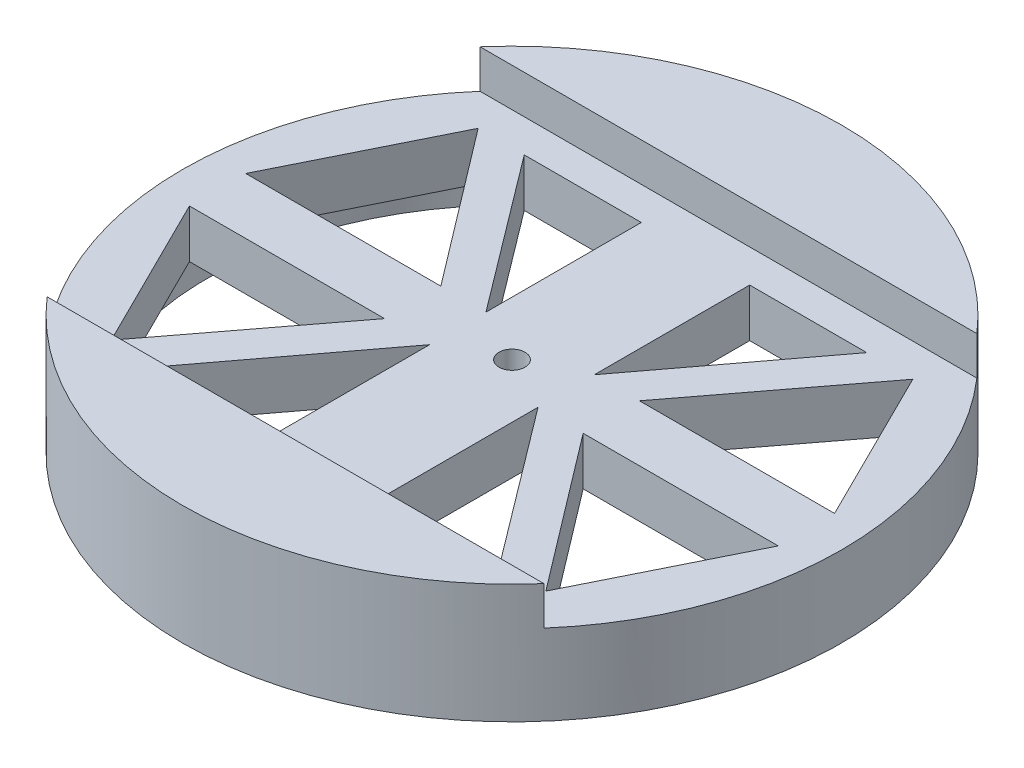
ISO-10303-21;
HEADER;
FILE_DESCRIPTION(('STEP AP214'),'2;1');
FILE_NAME('part.step','',(''),(''),'','','');
FILE_SCHEMA(('AUTOMOTIVE_DESIGN { 1 0 10303 214 1 1 1 1 }'));
ENDSEC;
DATA;
#1=APPLICATION_CONTEXT('core data for automotive mechanical design processes');
#2=APPLICATION_PROTOCOL_DEFINITION('international standard','automotive_design',2000,#1);
#3=PRODUCT_CONTEXT('',#1,'mechanical');
#4=PRODUCT('Part','Part','',(#3));
#5=PRODUCT_RELATED_PRODUCT_CATEGORY('part','',(#4));
#6=PRODUCT_DEFINITION_FORMATION('','',#4);
#7=PRODUCT_DEFINITION_CONTEXT('part definition',#1,'design');
#8=PRODUCT_DEFINITION('design','',#6,#7);
#9=PRODUCT_DEFINITION_SHAPE('','',#8);
#10=(LENGTH_UNIT() NAMED_UNIT(*) SI_UNIT(.MILLI.,.METRE.));
#11=(NAMED_UNIT(*) PLANE_ANGLE_UNIT() SI_UNIT($,.RADIAN.));
#12=(NAMED_UNIT(*) SI_UNIT($,.STERADIAN.) SOLID_ANGLE_UNIT());
#13=UNCERTAINTY_MEASURE_WITH_UNIT(LENGTH_MEASURE(1.E-05),#10,'distance_accuracy_value','');
#14=(GEOMETRIC_REPRESENTATION_CONTEXT(3) GLOBAL_UNCERTAINTY_ASSIGNED_CONTEXT((#13)) GLOBAL_UNIT_ASSIGNED_CONTEXT((#10,
#11,#12)) REPRESENTATION_CONTEXT('',''));
#15=CARTESIAN_POINT('',(0.,0.,0.));
#16=DIRECTION('',(0.,0.,1.));
#17=DIRECTION('',(1.,0.,0.));
#18=AXIS2_PLACEMENT_3D('',#15,#16,#17);
#19=CARTESIAN_POINT('',(0.,-1.39,0.));
#20=DIRECTION('',(0.,1.,0.));
#21=DIRECTION('',(0.,0.,1.));
#22=AXIS2_PLACEMENT_3D('',#19,#20,#21);
#23=CYLINDRICAL_SURFACE('',#22,3.);
#24=CARTESIAN_POINT('',(0.,18.61,0.));
#25=DIRECTION('',(0.,1.,0.));
#26=DIRECTION('',(0.,0.,1.));
#27=AXIS2_PLACEMENT_3D('',#24,#25,#26);
#28=CIRCLE('',#27,3.);
#29=CARTESIAN_POINT('',(0.,18.61,3.));
#30=VERTEX_POINT('',#29);
#31=EDGE_CURVE('E336',#30,#30,#28,.T.);
#32=ORIENTED_EDGE('',*,*,#31,.T.);
#33=EDGE_LOOP('',(#32));
#34=FACE_BOUND('',#33,.T.);
#35=CARTESIAN_POINT('',(0.,7.5,0.));
#36=DIRECTION('',(0.,-1.,0.));
#37=DIRECTION('',(0.,0.,-1.));
#38=AXIS2_PLACEMENT_3D('',#35,#36,#37);
#39=CIRCLE('',#38,3.);
#40=CARTESIAN_POINT('',(0.,7.5,-3.));
#41=VERTEX_POINT('',#40);
#42=EDGE_CURVE('E253',#41,#41,#39,.F.);
#43=ORIENTED_EDGE('',*,*,#42,.F.);
#44=EDGE_LOOP('',(#43));
#45=FACE_BOUND('',#44,.T.);
#46=ADVANCED_FACE('F44',(#34,#45),#23,.F.);
#47=CARTESIAN_POINT('',(-22.902913425769,0.,-6.49059266367803));
#48=DIRECTION('',(0.796272370202326,0.,-0.604938271604938));
#49=DIRECTION('',(-0.604938271604938,0.,-0.796272370202326));
#50=AXIS2_PLACEMENT_3D('',#47,#48,#49);
#51=PLANE('',#50);
#52=DIRECTION('',(-0.604938271604938,0.,-0.796272370202326));
#53=VECTOR('',#52,1.);
#54=CARTESIAN_POINT('',(-22.902913425769,7.5,-6.49059266367803));
#55=LINE('',#54,#53);
#56=CARTESIAN_POINT('',(-22.902913425769,7.5,-6.49059266367803));
#57=VERTEX_POINT('',#56);
#58=CARTESIAN_POINT('',(-50.1251356479912,7.5,-42.3228493227827));
#59=VERTEX_POINT('',#58);
#60=EDGE_CURVE('E59',#57,#59,#55,.T.);
#61=ORIENTED_EDGE('',*,*,#60,.F.);
#62=DIRECTION('',(0.,1.,0.));
#63=VECTOR('',#62,1.);
#64=CARTESIAN_POINT('',(-22.902913425769,0.,-6.49059266367803));
#65=LINE('',#64,#63);
#66=CARTESIAN_POINT('',(-22.902913425769,18.61,-6.49059266367803));
#67=VERTEX_POINT('',#66);
#68=EDGE_CURVE('E334',#57,#67,#65,.T.);
#69=ORIENTED_EDGE('',*,*,#68,.T.);
#70=DIRECTION('',(-0.604938271604938,0.,-0.796272370202326));
#71=VECTOR('',#70,1.);
#72=CARTESIAN_POINT('',(-22.902913425769,18.61,-6.49059266367803));
#73=LINE('',#72,#71);
#74=CARTESIAN_POINT('',(-50.1251356479912,18.61,-42.3228493227827));
#75=VERTEX_POINT('',#74);
#76=EDGE_CURVE('E296',#67,#75,#73,.T.);
#77=ORIENTED_EDGE('',*,*,#76,.T.);
#78=DIRECTION('',(0.,1.,0.));
#79=VECTOR('',#78,1.);
#80=CARTESIAN_POINT('',(-50.1251356479912,0.,-42.3228493227827));
#81=LINE('',#80,#79);
#82=EDGE_CURVE('E333',#59,#75,#81,.T.);
#83=ORIENTED_EDGE('',*,*,#82,.F.);
#84=EDGE_LOOP('',(#61,#69,#77,#83));
#85=FACE_BOUND('',#84,.T.);
#86=ADVANCED_FACE('F399',(#85),#51,.F.);
#87=CARTESIAN_POINT('',(-67.902913425769,0.,-6.49059266367803));
#88=DIRECTION('',(0.,0.,1.));
#89=DIRECTION('',(1.,0.,0.));
#90=AXIS2_PLACEMENT_3D('',#87,#88,#89);
#91=PLANE('',#90);
#92=DIRECTION('',(1.,0.,0.));
#93=VECTOR('',#92,1.);
#94=CARTESIAN_POINT('',(-67.902913425769,7.5,-6.49059266367803));
#95=LINE('',#94,#93);
#96=CARTESIAN_POINT('',(-67.902913425769,7.5,-6.49059266367803));
#97=VERTEX_POINT('',#96);
#98=EDGE_CURVE('E522',#97,#57,#95,.T.);
#99=ORIENTED_EDGE('',*,*,#98,.F.);
#100=DIRECTION('',(0.,1.,0.));
#101=VECTOR('',#100,1.);
#102=CARTESIAN_POINT('',(-67.902913425769,0.,-6.49059266367803));
#103=LINE('',#102,#101);
#104=CARTESIAN_POINT('',(-67.902913425769,18.61,-6.49059266367803));
#105=VERTEX_POINT('',#104);
#106=EDGE_CURVE('E337',#97,#105,#103,.T.);
#107=ORIENTED_EDGE('',*,*,#106,.T.);
#108=DIRECTION('',(1.,0.,0.));
#109=VECTOR('',#108,1.);
#110=CARTESIAN_POINT('',(-67.902913425769,18.61,-6.49059266367803));
#111=LINE('',#110,#109);
#112=EDGE_CURVE('E330',#105,#67,#111,.T.);
#113=ORIENTED_EDGE('',*,*,#112,.T.);
#114=ORIENTED_EDGE('',*,*,#68,.F.);
#115=EDGE_LOOP('',(#99,#107,#113,#114));
#116=FACE_BOUND('',#115,.T.);
#117=ADVANCED_FACE('F406',(#116),#91,.F.);
#118=CARTESIAN_POINT('',(-50.1251356479912,0.,-42.3228493227827));
#119=DIRECTION('',(-0.895806416477617,0.,-0.444444444444444));
#120=DIRECTION('',(-0.444444444444444,0.,0.895806416477617));
#121=AXIS2_PLACEMENT_3D('',#118,#119,#120);
#122=PLANE('',#121);
#123=DIRECTION('',(-0.444444444444444,0.,0.895806416477617));
#124=VECTOR('',#123,1.);
#125=CARTESIAN_POINT('',(-50.1251356479912,7.5,-42.3228493227827));
#126=LINE('',#125,#124);
#127=EDGE_CURVE('E519',#59,#97,#126,.T.);
#128=ORIENTED_EDGE('',*,*,#127,.F.);
#129=ORIENTED_EDGE('',*,*,#82,.T.);
#130=DIRECTION('',(-0.444444444444444,0.,0.895806416477617));
#131=VECTOR('',#130,1.);
#132=CARTESIAN_POINT('',(-50.1251356479912,18.61,-42.3228493227827));
#133=LINE('',#132,#131);
#134=EDGE_CURVE('E327',#75,#105,#133,.T.);
#135=ORIENTED_EDGE('',*,*,#134,.T.);
#136=ORIENTED_EDGE('',*,*,#106,.F.);
#137=EDGE_LOOP('',(#128,#129,#135,#136));
#138=FACE_BOUND('',#137,.T.);
#139=ADVANCED_FACE('F480',(#138),#122,.F.);
#140=CARTESIAN_POINT('',(50.1251356479912,0.,-42.3228493227827));
#141=DIRECTION('',(0.895806416477617,0.,-0.444444444444444));
#142=DIRECTION('',(-0.444444444444444,0.,-0.895806416477617));
#143=AXIS2_PLACEMENT_3D('',#140,#141,#142);
#144=PLANE('',#143);
#145=DIRECTION('',(-0.444444444444444,0.,-0.895806416477617));
#146=VECTOR('',#145,1.);
#147=CARTESIAN_POINT('',(50.1251356479912,7.5,-42.3228493227827));
#148=LINE('',#147,#146);
#149=CARTESIAN_POINT('',(67.902913425769,7.5,-6.49059266367803));
#150=VERTEX_POINT('',#149);
#151=CARTESIAN_POINT('',(50.1251356479912,7.5,-42.3228493227827));
#152=VERTEX_POINT('',#151);
#153=EDGE_CURVE('E67',#150,#152,#148,.T.);
#154=ORIENTED_EDGE('',*,*,#153,.F.);
#155=DIRECTION('',(0.,1.,0.));
#156=VECTOR('',#155,1.);
#157=CARTESIAN_POINT('',(67.902913425769,0.,-6.49059266367803));
#158=LINE('',#157,#156);
#159=CARTESIAN_POINT('',(67.902913425769,18.61,-6.49059266367803));
#160=VERTEX_POINT('',#159);
#161=EDGE_CURVE('E285',#150,#160,#158,.T.);
#162=ORIENTED_EDGE('',*,*,#161,.T.);
#163=DIRECTION('',(-0.444444444444444,0.,-0.895806416477617));
#164=VECTOR('',#163,1.);
#165=CARTESIAN_POINT('',(50.1251356479912,18.61,-42.3228493227827));
#166=LINE('',#165,#164);
#167=CARTESIAN_POINT('',(50.1251356479912,18.61,-42.3228493227827));
#168=VERTEX_POINT('',#167);
#169=EDGE_CURVE('E293',#160,#168,#166,.T.);
#170=ORIENTED_EDGE('',*,*,#169,.T.);
#171=DIRECTION('',(0.,1.,0.));
#172=VECTOR('',#171,1.);
#173=CARTESIAN_POINT('',(50.1251356479912,0.,-42.3228493227827));
#174=LINE('',#173,#172);
#175=EDGE_CURVE('E280',#152,#168,#174,.T.);
#176=ORIENTED_EDGE('',*,*,#175,.F.);
#177=EDGE_LOOP('',(#154,#162,#170,#176));
#178=FACE_BOUND('',#177,.T.);
#179=ADVANCED_FACE('F476',(#178),#144,.F.);
#180=CARTESIAN_POINT('',(67.902913425769,0.,-6.49059266367803));
#181=DIRECTION('',(0.,0.,1.));
#182=DIRECTION('',(1.,0.,0.));
#183=AXIS2_PLACEMENT_3D('',#180,#181,#182);
#184=PLANE('',#183);
#185=DIRECTION('',(1.,0.,0.));
#186=VECTOR('',#185,1.);
#187=CARTESIAN_POINT('',(67.902913425769,7.5,-6.49059266367803));
#188=LINE('',#187,#186);
#189=CARTESIAN_POINT('',(22.902913425769,7.5,-6.49059266367804));
#190=VERTEX_POINT('',#189);
#191=EDGE_CURVE('E608',#190,#150,#188,.T.);
#192=ORIENTED_EDGE('',*,*,#191,.F.);
#193=DIRECTION('',(0.,1.,0.));
#194=VECTOR('',#193,1.);
#195=CARTESIAN_POINT('',(22.902913425769,0.,-6.49059266367804));
#196=LINE('',#195,#194);
#197=CARTESIAN_POINT('',(22.902913425769,18.61,-6.49059266367804));
#198=VERTEX_POINT('',#197);
#199=EDGE_CURVE('E283',#190,#198,#196,.T.);
#200=ORIENTED_EDGE('',*,*,#199,.T.);
#201=DIRECTION('',(1.,0.,0.));
#202=VECTOR('',#201,1.);
#203=CARTESIAN_POINT('',(67.902913425769,18.61,-6.49059266367803));
#204=LINE('',#203,#202);
#205=EDGE_CURVE('E282',#198,#160,#204,.T.);
#206=ORIENTED_EDGE('',*,*,#205,.T.);
#207=ORIENTED_EDGE('',*,*,#161,.F.);
#208=EDGE_LOOP('',(#192,#200,#206,#207));
#209=FACE_BOUND('',#208,.T.);
#210=ADVANCED_FACE('F479',(#209),#184,.F.);
#211=CARTESIAN_POINT('',(22.902913425769,0.,-6.49059266367804));
#212=DIRECTION('',(-0.796272370202326,0.,-0.604938271604938));
#213=DIRECTION('',(-0.604938271604938,0.,0.796272370202326));
#214=AXIS2_PLACEMENT_3D('',#211,#212,#213);
#215=PLANE('',#214);
#216=DIRECTION('',(-0.604938271604938,0.,0.796272370202326));
#217=VECTOR('',#216,1.);
#218=CARTESIAN_POINT('',(22.902913425769,7.5,-6.49059266367804));
#219=LINE('',#218,#217);
#220=EDGE_CURVE('E606',#152,#190,#219,.T.);
#221=ORIENTED_EDGE('',*,*,#220,.F.);
#222=ORIENTED_EDGE('',*,*,#175,.T.);
#223=DIRECTION('',(-0.604938271604938,0.,0.796272370202326));
#224=VECTOR('',#223,1.);
#225=CARTESIAN_POINT('',(22.902913425769,18.61,-6.49059266367804));
#226=LINE('',#225,#224);
#227=EDGE_CURVE('E290',#168,#198,#226,.T.);
#228=ORIENTED_EDGE('',*,*,#227,.T.);
#229=ORIENTED_EDGE('',*,*,#199,.F.);
#230=EDGE_LOOP('',(#221,#222,#228,#229));
#231=FACE_BOUND('',#230,.T.);
#232=ADVANCED_FACE('F482',(#231),#215,.F.);
#233=CARTESIAN_POINT('',(22.902913425769,0.,6.49059266367804));
#234=DIRECTION('',(-0.796272370202326,0.,0.604938271604938));
#235=DIRECTION('',(0.604938271604938,0.,0.796272370202326));
#236=AXIS2_PLACEMENT_3D('',#233,#234,#235);
#237=PLANE('',#236);
#238=DIRECTION('',(0.604938271604938,0.,0.796272370202326));
#239=VECTOR('',#238,1.);
#240=CARTESIAN_POINT('',(22.902913425769,7.5,6.49059266367804));
#241=LINE('',#240,#239);
#242=CARTESIAN_POINT('',(22.902913425769,7.5,6.49059266367804));
#243=VERTEX_POINT('',#242);
#244=CARTESIAN_POINT('',(50.1251356479912,7.5,42.3228493227827));
#245=VERTEX_POINT('',#244);
#246=EDGE_CURVE('E604',#243,#245,#241,.T.);
#247=ORIENTED_EDGE('',*,*,#246,.F.);
#248=DIRECTION('',(0.,1.,0.));
#249=VECTOR('',#248,1.);
#250=CARTESIAN_POINT('',(22.902913425769,0.,6.49059266367804));
#251=LINE('',#250,#249);
#252=CARTESIAN_POINT('',(22.902913425769,18.61,6.49059266367804));
#253=VERTEX_POINT('',#252);
#254=EDGE_CURVE('E302',#243,#253,#251,.T.);
#255=ORIENTED_EDGE('',*,*,#254,.T.);
#256=DIRECTION('',(0.604938271604938,0.,0.796272370202326));
#257=VECTOR('',#256,1.);
#258=CARTESIAN_POINT('',(22.902913425769,18.61,6.49059266367804));
#259=LINE('',#258,#257);
#260=CARTESIAN_POINT('',(50.1251356479912,18.61,42.3228493227827));
#261=VERTEX_POINT('',#260);
#262=EDGE_CURVE('E287',#253,#261,#259,.T.);
#263=ORIENTED_EDGE('',*,*,#262,.T.);
#264=DIRECTION('',(0.,1.,0.));
#265=VECTOR('',#264,1.);
#266=CARTESIAN_POINT('',(50.1251356479912,0.,42.3228493227827));
#267=LINE('',#266,#265);
#268=EDGE_CURVE('E297',#245,#261,#267,.T.);
#269=ORIENTED_EDGE('',*,*,#268,.F.);
#270=EDGE_LOOP('',(#247,#255,#263,#269));
#271=FACE_BOUND('',#270,.T.);
#272=ADVANCED_FACE('F485',(#271),#237,.F.);
#273=CARTESIAN_POINT('',(67.902913425769,0.,6.49059266367803));
#274=DIRECTION('',(0.,0.,-1.));
#275=DIRECTION('',(-1.,0.,0.));
#276=AXIS2_PLACEMENT_3D('',#273,#274,#275);
#277=PLANE('',#276);
#278=DIRECTION('',(-1.,0.,0.));
#279=VECTOR('',#278,1.);
#280=CARTESIAN_POINT('',(67.902913425769,7.5,6.49059266367803));
#281=LINE('',#280,#279);
#282=CARTESIAN_POINT('',(67.902913425769,7.5,6.49059266367803));
#283=VERTEX_POINT('',#282);
#284=EDGE_CURVE('E602',#283,#243,#281,.T.);
#285=ORIENTED_EDGE('',*,*,#284,.F.);
#286=DIRECTION('',(0.,1.,0.));
#287=VECTOR('',#286,1.);
#288=CARTESIAN_POINT('',(67.902913425769,0.,6.49059266367803));
#289=LINE('',#288,#287);
#290=CARTESIAN_POINT('',(67.902913425769,18.61,6.49059266367803));
#291=VERTEX_POINT('',#290);
#292=EDGE_CURVE('E300',#283,#291,#289,.T.);
#293=ORIENTED_EDGE('',*,*,#292,.T.);
#294=DIRECTION('',(-1.,0.,0.));
#295=VECTOR('',#294,1.);
#296=CARTESIAN_POINT('',(67.902913425769,18.61,6.49059266367803));
#297=LINE('',#296,#295);
#298=EDGE_CURVE('E299',#291,#253,#297,.T.);
#299=ORIENTED_EDGE('',*,*,#298,.T.);
#300=ORIENTED_EDGE('',*,*,#254,.F.);
#301=EDGE_LOOP('',(#285,#293,#299,#300));
#302=FACE_BOUND('',#301,.T.);
#303=ADVANCED_FACE('F492',(#302),#277,.F.);
#304=CARTESIAN_POINT('',(50.1251356479912,0.,42.3228493227827));
#305=DIRECTION('',(0.895806416477617,0.,0.444444444444444));
#306=DIRECTION('',(0.444444444444444,0.,-0.895806416477617));
#307=AXIS2_PLACEMENT_3D('',#304,#305,#306);
#308=PLANE('',#307);
#309=DIRECTION('',(0.444444444444444,0.,-0.895806416477617));
#310=VECTOR('',#309,1.);
#311=CARTESIAN_POINT('',(50.1251356479912,7.5,42.3228493227827));
#312=LINE('',#311,#310);
#313=EDGE_CURVE('E600',#245,#283,#312,.T.);
#314=ORIENTED_EDGE('',*,*,#313,.F.);
#315=ORIENTED_EDGE('',*,*,#268,.T.);
#316=DIRECTION('',(0.444444444444444,0.,-0.895806416477617));
#317=VECTOR('',#316,1.);
#318=CARTESIAN_POINT('',(50.1251356479912,18.61,42.3228493227827));
#319=LINE('',#318,#317);
#320=EDGE_CURVE('E307',#261,#291,#319,.T.);
#321=ORIENTED_EDGE('',*,*,#320,.T.);
#322=ORIENTED_EDGE('',*,*,#292,.F.);
#323=EDGE_LOOP('',(#314,#315,#321,#322));
#324=FACE_BOUND('',#323,.T.);
#325=ADVANCED_FACE('F494',(#324),#308,.F.);
#326=CARTESIAN_POINT('',(-50.1251356479912,0.,42.3228493227827));
#327=DIRECTION('',(-0.895806416477617,0.,0.444444444444444));
#328=DIRECTION('',(0.444444444444444,0.,0.895806416477617));
#329=AXIS2_PLACEMENT_3D('',#326,#327,#328);
#330=PLANE('',#329);
#331=DIRECTION('',(0.444444444444444,0.,0.895806416477617));
#332=VECTOR('',#331,1.);
#333=CARTESIAN_POINT('',(-50.1251356479912,7.5,42.3228493227827));
#334=LINE('',#333,#332);
#335=CARTESIAN_POINT('',(-67.902913425769,7.5,6.49059266367802));
#336=VERTEX_POINT('',#335);
#337=CARTESIAN_POINT('',(-50.1251356479912,7.5,42.3228493227827));
#338=VERTEX_POINT('',#337);
#339=EDGE_CURVE('E598',#336,#338,#334,.T.);
#340=ORIENTED_EDGE('',*,*,#339,.F.);
#341=DIRECTION('',(0.,1.,0.));
#342=VECTOR('',#341,1.);
#343=CARTESIAN_POINT('',(-67.902913425769,0.,6.49059266367802));
#344=LINE('',#343,#342);
#345=CARTESIAN_POINT('',(-67.902913425769,18.61,6.49059266367802));
#346=VERTEX_POINT('',#345);
#347=EDGE_CURVE('E276',#336,#346,#344,.T.);
#348=ORIENTED_EDGE('',*,*,#347,.T.);
#349=DIRECTION('',(0.444444444444444,0.,0.895806416477617));
#350=VECTOR('',#349,1.);
#351=CARTESIAN_POINT('',(-50.1251356479912,18.61,42.3228493227827));
#352=LINE('',#351,#350);
#353=CARTESIAN_POINT('',(-50.1251356479912,18.61,42.3228493227827));
#354=VERTEX_POINT('',#353);
#355=EDGE_CURVE('E304',#346,#354,#352,.T.);
#356=ORIENTED_EDGE('',*,*,#355,.T.);
#357=DIRECTION('',(0.,1.,0.));
#358=VECTOR('',#357,1.);
#359=CARTESIAN_POINT('',(-50.1251356479912,0.,42.3228493227827));
#360=LINE('',#359,#358);
#361=EDGE_CURVE('E312',#338,#354,#360,.T.);
#362=ORIENTED_EDGE('',*,*,#361,.F.);
#363=EDGE_LOOP('',(#340,#348,#356,#362));
#364=FACE_BOUND('',#363,.T.);
#365=ADVANCED_FACE('F497',(#364),#330,.F.);
#366=CARTESIAN_POINT('',(-67.902913425769,0.,6.49059266367802));
#367=DIRECTION('',(0.,0.,-1.));
#368=DIRECTION('',(-1.,0.,0.));
#369=AXIS2_PLACEMENT_3D('',#366,#367,#368);
#370=PLANE('',#369);
#371=DIRECTION('',(-1.,0.,0.));
#372=VECTOR('',#371,1.);
#373=CARTESIAN_POINT('',(-67.902913425769,7.5,6.49059266367802));
#374=LINE('',#373,#372);
#375=CARTESIAN_POINT('',(-22.902913425769,7.5,6.49059266367803));
#376=VERTEX_POINT('',#375);
#377=EDGE_CURVE('E596',#376,#336,#374,.T.);
#378=ORIENTED_EDGE('',*,*,#377,.F.);
#379=DIRECTION('',(0.,1.,0.));
#380=VECTOR('',#379,1.);
#381=CARTESIAN_POINT('',(-22.902913425769,0.,6.49059266367803));
#382=LINE('',#381,#380);
#383=CARTESIAN_POINT('',(-22.902913425769,18.61,6.49059266367803));
#384=VERTEX_POINT('',#383);
#385=EDGE_CURVE('E315',#376,#384,#382,.T.);
#386=ORIENTED_EDGE('',*,*,#385,.T.);
#387=DIRECTION('',(-1.,0.,0.));
#388=VECTOR('',#387,1.);
#389=CARTESIAN_POINT('',(-67.902913425769,18.61,6.49059266367802));
#390=LINE('',#389,#388);
#391=EDGE_CURVE('E314',#384,#346,#390,.T.);
#392=ORIENTED_EDGE('',*,*,#391,.T.);
#393=ORIENTED_EDGE('',*,*,#347,.F.);
#394=EDGE_LOOP('',(#378,#386,#392,#393));
#395=FACE_BOUND('',#394,.T.);
#396=ADVANCED_FACE('F504',(#395),#370,.F.);
#397=CARTESIAN_POINT('',(-22.902913425769,0.,6.49059266367803));
#398=DIRECTION('',(0.796272370202326,0.,0.604938271604938));
#399=DIRECTION('',(0.604938271604938,0.,-0.796272370202326));
#400=AXIS2_PLACEMENT_3D('',#397,#398,#399);
#401=PLANE('',#400);
#402=DIRECTION('',(0.604938271604938,0.,-0.796272370202326));
#403=VECTOR('',#402,1.);
#404=CARTESIAN_POINT('',(-22.902913425769,7.5,6.49059266367803));
#405=LINE('',#404,#403);
#406=EDGE_CURVE('E594',#338,#376,#405,.T.);
#407=ORIENTED_EDGE('',*,*,#406,.F.);
#408=ORIENTED_EDGE('',*,*,#361,.T.);
#409=DIRECTION('',(0.604938271604938,0.,-0.796272370202326));
#410=VECTOR('',#409,1.);
#411=CARTESIAN_POINT('',(-22.902913425769,18.61,6.49059266367803));
#412=LINE('',#411,#410);
#413=EDGE_CURVE('E320',#354,#384,#412,.T.);
#414=ORIENTED_EDGE('',*,*,#413,.T.);
#415=ORIENTED_EDGE('',*,*,#385,.F.);
#416=EDGE_LOOP('',(#407,#408,#414,#415));
#417=FACE_BOUND('',#416,.T.);
#418=ADVANCED_FACE('F474',(#417),#401,.F.);
#419=CARTESIAN_POINT('',(-12.5,0.,-6.49059266367805));
#420=DIRECTION('',(-0.798652029973296,0.,0.601793099843737));
#421=DIRECTION('',(0.601793099843737,0.,0.798652029973296));
#422=AXIS2_PLACEMENT_3D('',#419,#420,#421);
#423=PLANE('',#422);
#424=DIRECTION('',(0.601793099843737,0.,0.798652029973296));
#425=VECTOR('',#424,1.);
#426=CARTESIAN_POINT('',(-12.5,7.5,-6.49059266367805));
#427=LINE('',#426,#425);
#428=CARTESIAN_POINT('',(-39.5,7.5,-42.3228493227827));
#429=VERTEX_POINT('',#428);
#430=CARTESIAN_POINT('',(-12.5,7.5,-6.49059266367805));
#431=VERTEX_POINT('',#430);
#432=EDGE_CURVE('E592',#429,#431,#427,.T.);
#433=ORIENTED_EDGE('',*,*,#432,.F.);
#434=DIRECTION('',(0.,1.,0.));
#435=VECTOR('',#434,1.);
#436=CARTESIAN_POINT('',(-39.5,0.,-42.3228493227827));
#437=LINE('',#436,#435);
#438=CARTESIAN_POINT('',(-39.5,18.61,-42.3228493227827));
#439=VERTEX_POINT('',#438);
#440=EDGE_CURVE('E274',#429,#439,#437,.T.);
#441=ORIENTED_EDGE('',*,*,#440,.T.);
#442=DIRECTION('',(0.601793099843737,0.,0.798652029973296));
#443=VECTOR('',#442,1.);
#444=CARTESIAN_POINT('',(-12.5,18.61,-6.49059266367805));
#445=LINE('',#444,#443);
#446=CARTESIAN_POINT('',(-12.5,18.61,-6.49059266367805));
#447=VERTEX_POINT('',#446);
#448=EDGE_CURVE('E263',#439,#447,#445,.T.);
#449=ORIENTED_EDGE('',*,*,#448,.T.);
#450=DIRECTION('',(0.,1.,0.));
#451=VECTOR('',#450,1.);
#452=CARTESIAN_POINT('',(-12.5,0.,-6.49059266367805));
#453=LINE('',#452,#451);
#454=EDGE_CURVE('E273',#431,#447,#453,.T.);
#455=ORIENTED_EDGE('',*,*,#454,.F.);
#456=EDGE_LOOP('',(#433,#441,#449,#455));
#457=FACE_BOUND('',#456,.T.);
#458=ADVANCED_FACE('F467',(#457),#423,.F.);
#459=CARTESIAN_POINT('',(-12.5,0.,-42.3228493227827));
#460=DIRECTION('',(0.,0.,-1.));
#461=DIRECTION('',(-1.,0.,0.));
#462=AXIS2_PLACEMENT_3D('',#459,#460,#461);
#463=PLANE('',#462);
#464=DIRECTION('',(-1.,0.,0.));
#465=VECTOR('',#464,1.);
#466=CARTESIAN_POINT('',(-12.5,7.5,-42.3228493227827));
#467=LINE('',#466,#465);
#468=CARTESIAN_POINT('',(-12.5,7.5,-42.3228493227827));
#469=VERTEX_POINT('',#468);
#470=EDGE_CURVE('E590',#469,#429,#467,.T.);
#471=ORIENTED_EDGE('',*,*,#470,.F.);
#472=DIRECTION('',(0.,1.,0.));
#473=VECTOR('',#472,1.);
#474=CARTESIAN_POINT('',(-12.5,0.,-42.3228493227827));
#475=LINE('',#474,#473);
#476=CARTESIAN_POINT('',(-12.5,18.61,-42.3228493227827));
#477=VERTEX_POINT('',#476);
#478=EDGE_CURVE('E277',#469,#477,#475,.T.);
#479=ORIENTED_EDGE('',*,*,#478,.T.);
#480=DIRECTION('',(-1.,0.,0.));
#481=VECTOR('',#480,1.);
#482=CARTESIAN_POINT('',(-12.5,18.61,-42.3228493227827));
#483=LINE('',#482,#481);
#484=EDGE_CURVE('E270',#477,#439,#483,.T.);
#485=ORIENTED_EDGE('',*,*,#484,.T.);
#486=ORIENTED_EDGE('',*,*,#440,.F.);
#487=EDGE_LOOP('',(#471,#479,#485,#486));
#488=FACE_BOUND('',#487,.T.);
#489=ADVANCED_FACE('F464',(#488),#463,.F.);
#490=CARTESIAN_POINT('',(-12.5,0.,-6.49059266367805));
#491=DIRECTION('',(1.,0.,0.));
#492=DIRECTION('',(0.,0.,-1.));
#493=AXIS2_PLACEMENT_3D('',#490,#491,#492);
#494=PLANE('',#493);
#495=DIRECTION('',(0.,0.,-1.));
#496=VECTOR('',#495,1.);
#497=CARTESIAN_POINT('',(-12.5,7.5,-6.49059266367805));
#498=LINE('',#497,#496);
#499=EDGE_CURVE('E588',#431,#469,#498,.T.);
#500=ORIENTED_EDGE('',*,*,#499,.F.);
#501=ORIENTED_EDGE('',*,*,#454,.T.);
#502=DIRECTION('',(0.,0.,-1.));
#503=VECTOR('',#502,1.);
#504=CARTESIAN_POINT('',(-12.5,18.61,-6.49059266367805));
#505=LINE('',#504,#503);
#506=EDGE_CURVE('E266',#447,#477,#505,.T.);
#507=ORIENTED_EDGE('',*,*,#506,.T.);
#508=ORIENTED_EDGE('',*,*,#478,.F.);
#509=EDGE_LOOP('',(#500,#501,#507,#508));
#510=FACE_BOUND('',#509,.T.);
#511=ADVANCED_FACE('F437',(#510),#494,.F.);
#512=CARTESIAN_POINT('',(12.5,0.,-6.49059266367805));
#513=DIRECTION('',(-1.,0.,0.));
#514=DIRECTION('',(0.,0.,1.));
#515=AXIS2_PLACEMENT_3D('',#512,#513,#514);
#516=PLANE('',#515);
#517=DIRECTION('',(0.,0.,1.));
#518=VECTOR('',#517,1.);
#519=CARTESIAN_POINT('',(12.5,7.5,-6.49059266367805));
#520=LINE('',#519,#518);
#521=CARTESIAN_POINT('',(12.5,7.5,-42.3228493227827));
#522=VERTEX_POINT('',#521);
#523=CARTESIAN_POINT('',(12.5,7.5,-6.49059266367805));
#524=VERTEX_POINT('',#523);
#525=EDGE_CURVE('E586',#522,#524,#520,.T.);
#526=ORIENTED_EDGE('',*,*,#525,.F.);
#527=DIRECTION('',(0.,1.,0.));
#528=VECTOR('',#527,1.);
#529=CARTESIAN_POINT('',(12.5,0.,-42.3228493227827));
#530=LINE('',#529,#528);
#531=CARTESIAN_POINT('',(12.5,18.61,-42.3228493227827));
#532=VERTEX_POINT('',#531);
#533=EDGE_CURVE('E541',#522,#532,#530,.T.);
#534=ORIENTED_EDGE('',*,*,#533,.T.);
#535=DIRECTION('',(0.,0.,1.));
#536=VECTOR('',#535,1.);
#537=CARTESIAN_POINT('',(12.5,18.61,-6.49059266367805));
#538=LINE('',#537,#536);
#539=CARTESIAN_POINT('',(12.5,18.61,-6.49059266367805));
#540=VERTEX_POINT('',#539);
#541=EDGE_CURVE('E267',#532,#540,#538,.T.);
#542=ORIENTED_EDGE('',*,*,#541,.T.);
#543=DIRECTION('',(0.,1.,0.));
#544=VECTOR('',#543,1.);
#545=CARTESIAN_POINT('',(12.5,0.,-6.49059266367805));
#546=LINE('',#545,#544);
#547=EDGE_CURVE('E536',#524,#540,#546,.T.);
#548=ORIENTED_EDGE('',*,*,#547,.F.);
#549=EDGE_LOOP('',(#526,#534,#542,#548));
#550=FACE_BOUND('',#549,.T.);
#551=ADVANCED_FACE('F433',(#550),#516,.F.);
#552=CARTESIAN_POINT('',(12.5,0.,-42.3228493227827));
#553=DIRECTION('',(0.,0.,-1.));
#554=DIRECTION('',(-1.,0.,0.));
#555=AXIS2_PLACEMENT_3D('',#552,#553,#554);
#556=PLANE('',#555);
#557=DIRECTION('',(-1.,0.,0.));
#558=VECTOR('',#557,1.);
#559=CARTESIAN_POINT('',(12.5,7.5,-42.3228493227827));
#560=LINE('',#559,#558);
#561=CARTESIAN_POINT('',(39.5,7.5,-42.3228493227827));
#562=VERTEX_POINT('',#561);
#563=EDGE_CURVE('E584',#562,#522,#560,.T.);
#564=ORIENTED_EDGE('',*,*,#563,.F.);
#565=DIRECTION('',(0.,1.,0.));
#566=VECTOR('',#565,1.);
#567=CARTESIAN_POINT('',(39.5,0.,-42.3228493227827));
#568=LINE('',#567,#566);
#569=CARTESIAN_POINT('',(39.5,18.61,-42.3228493227827));
#570=VERTEX_POINT('',#569);
#571=EDGE_CURVE('E539',#562,#570,#568,.T.);
#572=ORIENTED_EDGE('',*,*,#571,.T.);
#573=DIRECTION('',(-1.,0.,0.));
#574=VECTOR('',#573,1.);
#575=CARTESIAN_POINT('',(12.5,18.61,-42.3228493227827));
#576=LINE('',#575,#574);
#577=EDGE_CURVE('E538',#570,#532,#576,.T.);
#578=ORIENTED_EDGE('',*,*,#577,.T.);
#579=ORIENTED_EDGE('',*,*,#533,.F.);
#580=EDGE_LOOP('',(#564,#572,#578,#579));
#581=FACE_BOUND('',#580,.T.);
#582=ADVANCED_FACE('F436',(#581),#556,.F.);
#583=CARTESIAN_POINT('',(12.5,0.,-6.49059266367805));
#584=DIRECTION('',(0.798652029973296,0.,0.601793099843737));
#585=DIRECTION('',(0.601793099843737,0.,-0.798652029973296));
#586=AXIS2_PLACEMENT_3D('',#583,#584,#585);
#587=PLANE('',#586);
#588=DIRECTION('',(0.601793099843737,0.,-0.798652029973296));
#589=VECTOR('',#588,1.);
#590=CARTESIAN_POINT('',(12.5,7.5,-6.49059266367805));
#591=LINE('',#590,#589);
#592=EDGE_CURVE('E582',#524,#562,#591,.T.);
#593=ORIENTED_EDGE('',*,*,#592,.F.);
#594=ORIENTED_EDGE('',*,*,#547,.T.);
#595=DIRECTION('',(0.601793099843737,0.,-0.798652029973296));
#596=VECTOR('',#595,1.);
#597=CARTESIAN_POINT('',(12.5,18.61,-6.49059266367805));
#598=LINE('',#597,#596);
#599=EDGE_CURVE('E546',#540,#570,#598,.T.);
#600=ORIENTED_EDGE('',*,*,#599,.T.);
#601=ORIENTED_EDGE('',*,*,#571,.F.);
#602=EDGE_LOOP('',(#593,#594,#600,#601));
#603=FACE_BOUND('',#602,.T.);
#604=ADVANCED_FACE('F439',(#603),#587,.F.);
#605=CARTESIAN_POINT('',(12.5,0.,6.49059266367805));
#606=DIRECTION('',(0.798652029973296,0.,-0.601793099843737));
#607=DIRECTION('',(-0.601793099843737,0.,-0.798652029973296));
#608=AXIS2_PLACEMENT_3D('',#605,#606,#607);
#609=PLANE('',#608);
#610=DIRECTION('',(-0.601793099843737,0.,-0.798652029973296));
#611=VECTOR('',#610,1.);
#612=CARTESIAN_POINT('',(12.5,7.5,6.49059266367805));
#613=LINE('',#612,#611);
#614=CARTESIAN_POINT('',(39.5,7.5,42.3228493227827));
#615=VERTEX_POINT('',#614);
#616=CARTESIAN_POINT('',(12.5,7.5,6.49059266367805));
#617=VERTEX_POINT('',#616);
#618=EDGE_CURVE('E577',#615,#617,#613,.T.);
#619=ORIENTED_EDGE('',*,*,#618,.F.);
#620=DIRECTION('',(0.,1.,0.));
#621=VECTOR('',#620,1.);
#622=CARTESIAN_POINT('',(39.5,0.,42.3228493227827));
#623=LINE('',#622,#621);
#624=CARTESIAN_POINT('',(39.5,18.61,42.3228493227827));
#625=VERTEX_POINT('',#624);
#626=EDGE_CURVE('E262',#615,#625,#623,.T.);
#627=ORIENTED_EDGE('',*,*,#626,.T.);
#628=DIRECTION('',(-0.601793099843737,0.,-0.798652029973296));
#629=VECTOR('',#628,1.);
#630=CARTESIAN_POINT('',(12.5,18.61,6.49059266367805));
#631=LINE('',#630,#629);
#632=CARTESIAN_POINT('',(12.5,18.61,6.49059266367805));
#633=VERTEX_POINT('',#632);
#634=EDGE_CURVE('E543',#625,#633,#631,.T.);
#635=ORIENTED_EDGE('',*,*,#634,.T.);
#636=DIRECTION('',(0.,1.,0.));
#637=VECTOR('',#636,1.);
#638=CARTESIAN_POINT('',(12.5,0.,6.49059266367805));
#639=LINE('',#638,#637);
#640=EDGE_CURVE('E551',#617,#633,#639,.T.);
#641=ORIENTED_EDGE('',*,*,#640,.F.);
#642=EDGE_LOOP('',(#619,#627,#635,#641));
#643=FACE_BOUND('',#642,.T.);
#644=ADVANCED_FACE('F442',(#643),#609,.F.);
#645=CARTESIAN_POINT('',(12.5,0.,42.3228493227827));
#646=DIRECTION('',(0.,0.,1.));
#647=DIRECTION('',(1.,0.,0.));
#648=AXIS2_PLACEMENT_3D('',#645,#646,#647);
#649=PLANE('',#648);
#650=DIRECTION('',(1.,0.,0.));
#651=VECTOR('',#650,1.);
#652=CARTESIAN_POINT('',(12.5,7.5,42.3228493227827));
#653=LINE('',#652,#651);
#654=CARTESIAN_POINT('',(12.5,7.5,42.3228493227827));
#655=VERTEX_POINT('',#654);
#656=EDGE_CURVE('E575',#655,#615,#653,.T.);
#657=ORIENTED_EDGE('',*,*,#656,.F.);
#658=DIRECTION('',(0.,1.,0.));
#659=VECTOR('',#658,1.);
#660=CARTESIAN_POINT('',(12.5,0.,42.3228493227827));
#661=LINE('',#660,#659);
#662=CARTESIAN_POINT('',(12.5,18.61,42.3228493227827));
#663=VERTEX_POINT('',#662);
#664=EDGE_CURVE('E554',#655,#663,#661,.T.);
#665=ORIENTED_EDGE('',*,*,#664,.T.);
#666=DIRECTION('',(1.,0.,0.));
#667=VECTOR('',#666,1.);
#668=CARTESIAN_POINT('',(12.5,18.61,42.3228493227827));
#669=LINE('',#668,#667);
#670=EDGE_CURVE('E553',#663,#625,#669,.T.);
#671=ORIENTED_EDGE('',*,*,#670,.T.);
#672=ORIENTED_EDGE('',*,*,#626,.F.);
#673=EDGE_LOOP('',(#657,#665,#671,#672));
#674=FACE_BOUND('',#673,.T.);
#675=ADVANCED_FACE('F449',(#674),#649,.F.);
#676=CARTESIAN_POINT('',(12.5,0.,6.49059266367805));
#677=DIRECTION('',(-1.,0.,0.));
#678=DIRECTION('',(0.,0.,1.));
#679=AXIS2_PLACEMENT_3D('',#676,#677,#678);
#680=PLANE('',#679);
#681=DIRECTION('',(0.,0.,1.));
#682=VECTOR('',#681,1.);
#683=CARTESIAN_POINT('',(12.5,7.5,6.49059266367805));
#684=LINE('',#683,#682);
#685=EDGE_CURVE('E572',#617,#655,#684,.T.);
#686=ORIENTED_EDGE('',*,*,#685,.F.);
#687=ORIENTED_EDGE('',*,*,#640,.T.);
#688=DIRECTION('',(0.,0.,1.));
#689=VECTOR('',#688,1.);
#690=CARTESIAN_POINT('',(12.5,18.61,6.49059266367805));
#691=LINE('',#690,#689);
#692=EDGE_CURVE('E559',#633,#663,#691,.T.);
#693=ORIENTED_EDGE('',*,*,#692,.T.);
#694=ORIENTED_EDGE('',*,*,#664,.F.);
#695=EDGE_LOOP('',(#686,#687,#693,#694));
#696=FACE_BOUND('',#695,.T.);
#697=ADVANCED_FACE('F451',(#696),#680,.F.);
#698=CARTESIAN_POINT('',(-12.5,0.,6.49059266367805));
#699=DIRECTION('',(1.,0.,0.));
#700=DIRECTION('',(0.,0.,-1.));
#701=AXIS2_PLACEMENT_3D('',#698,#699,#700);
#702=PLANE('',#701);
#703=DIRECTION('',(0.,0.,-1.));
#704=VECTOR('',#703,1.);
#705=CARTESIAN_POINT('',(-12.5,7.5,6.49059266367805));
#706=LINE('',#705,#704);
#707=CARTESIAN_POINT('',(-12.5,7.5,42.3228493227827));
#708=VERTEX_POINT('',#707);
#709=CARTESIAN_POINT('',(-12.5,7.5,6.49059266367805));
#710=VERTEX_POINT('',#709);
#711=EDGE_CURVE('E232',#708,#710,#706,.T.);
#712=ORIENTED_EDGE('',*,*,#711,.F.);
#713=DIRECTION('',(0.,1.,0.));
#714=VECTOR('',#713,1.);
#715=CARTESIAN_POINT('',(-12.5,0.,42.3228493227827));
#716=LINE('',#715,#714);
#717=CARTESIAN_POINT('',(-12.5,18.61,42.3228493227827));
#718=VERTEX_POINT('',#717);
#719=EDGE_CURVE('E242',#708,#718,#716,.T.);
#720=ORIENTED_EDGE('',*,*,#719,.T.);
#721=DIRECTION('',(0.,0.,-1.));
#722=VECTOR('',#721,1.);
#723=CARTESIAN_POINT('',(-12.5,18.61,6.49059266367805));
#724=LINE('',#723,#722);
#725=CARTESIAN_POINT('',(-12.5,18.61,6.49059266367805));
#726=VERTEX_POINT('',#725);
#727=EDGE_CURVE('E259',#718,#726,#724,.T.);
#728=ORIENTED_EDGE('',*,*,#727,.T.);
#729=DIRECTION('',(0.,1.,0.));
#730=VECTOR('',#729,1.);
#731=CARTESIAN_POINT('',(-12.5,0.,6.49059266367805));
#732=LINE('',#731,#730);
#733=EDGE_CURVE('E249',#710,#726,#732,.T.);
#734=ORIENTED_EDGE('',*,*,#733,.F.);
#735=EDGE_LOOP('',(#712,#720,#728,#734));
#736=FACE_BOUND('',#735,.T.);
#737=ADVANCED_FACE('F454',(#736),#702,.F.);
#738=CARTESIAN_POINT('',(-12.5,0.,42.3228493227827));
#739=DIRECTION('',(0.,0.,1.));
#740=DIRECTION('',(1.,0.,0.));
#741=AXIS2_PLACEMENT_3D('',#738,#739,#740);
#742=PLANE('',#741);
#743=DIRECTION('',(1.,0.,0.));
#744=VECTOR('',#743,1.);
#745=CARTESIAN_POINT('',(-12.5,7.5,42.3228493227827));
#746=LINE('',#745,#744);
#747=CARTESIAN_POINT('',(-39.5,7.5,42.3228493227827));
#748=VERTEX_POINT('',#747);
#749=EDGE_CURVE('E230',#748,#708,#746,.T.);
#750=ORIENTED_EDGE('',*,*,#749,.F.);
#751=DIRECTION('',(0.,1.,0.));
#752=VECTOR('',#751,1.);
#753=CARTESIAN_POINT('',(-39.5,0.,42.3228493227827));
#754=LINE('',#753,#752);
#755=CARTESIAN_POINT('',(-39.5,18.61,42.3228493227827));
#756=VERTEX_POINT('',#755);
#757=EDGE_CURVE('E240',#748,#756,#754,.T.);
#758=ORIENTED_EDGE('',*,*,#757,.T.);
#759=DIRECTION('',(1.,0.,0.));
#760=VECTOR('',#759,1.);
#761=CARTESIAN_POINT('',(-12.5,18.61,42.3228493227827));
#762=LINE('',#761,#760);
#763=EDGE_CURVE('E251',#756,#718,#762,.T.);
#764=ORIENTED_EDGE('',*,*,#763,.T.);
#765=ORIENTED_EDGE('',*,*,#719,.F.);
#766=EDGE_LOOP('',(#750,#758,#764,#765));
#767=FACE_BOUND('',#766,.T.);
#768=ADVANCED_FACE('F238',(#767),#742,.F.);
#769=CARTESIAN_POINT('',(-12.5,0.,6.49059266367805));
#770=DIRECTION('',(-0.798652029973296,0.,-0.601793099843737));
#771=DIRECTION('',(-0.601793099843737,0.,0.798652029973296));
#772=AXIS2_PLACEMENT_3D('',#769,#770,#771);
#773=PLANE('',#772);
#774=DIRECTION('',(-0.601793099843737,0.,0.798652029973296));
#775=VECTOR('',#774,1.);
#776=CARTESIAN_POINT('',(-12.5,7.5,6.49059266367805));
#777=LINE('',#776,#775);
#778=EDGE_CURVE('E11',#710,#748,#777,.T.);
#779=ORIENTED_EDGE('',*,*,#778,.F.);
#780=ORIENTED_EDGE('',*,*,#733,.T.);
#781=DIRECTION('',(-0.601793099843737,0.,0.798652029973296));
#782=VECTOR('',#781,1.);
#783=CARTESIAN_POINT('',(-12.5,18.61,6.49059266367805));
#784=LINE('',#783,#782);
#785=EDGE_CURVE('E247',#726,#756,#784,.T.);
#786=ORIENTED_EDGE('',*,*,#785,.T.);
#787=ORIENTED_EDGE('',*,*,#757,.F.);
#788=EDGE_LOOP('',(#779,#780,#786,#787));
#789=FACE_BOUND('',#788,.T.);
#790=ADVANCED_FACE('F245',(#789),#773,.F.);
#791=CARTESIAN_POINT('',(0.,27.5,0.));
#792=DIRECTION('',(0.,1.,0.));
#793=DIRECTION('',(0.,0.,1.));
#794=AXIS2_PLACEMENT_3D('',#791,#792,#793);
#795=PLANE('',#794);
#796=DIRECTION('',(-1.,0.,0.));
#797=VECTOR('',#796,1.);
#798=CARTESIAN_POINT('',(0.,27.5,-49.9317963849467));
#799=LINE('',#798,#797);
#800=CARTESIAN_POINT('',(57.2958611923429,27.5,-49.9317963849467));
#801=VERTEX_POINT('',#800);
#802=CARTESIAN_POINT('',(-57.2958611923429,27.5,-49.9317963849467));
#803=VERTEX_POINT('',#802);
#804=EDGE_CURVE('E369',#801,#803,#799,.T.);
#805=ORIENTED_EDGE('',*,*,#804,.F.);
#806=CARTESIAN_POINT('',(0.,27.5,0.));
#807=DIRECTION('',(0.,1.,0.));
#808=DIRECTION('',(0.,0.,1.));
#809=AXIS2_PLACEMENT_3D('',#806,#807,#808);
#810=CIRCLE('',#809,76.);
#811=EDGE_CURVE('E364',#801,#803,#810,.T.);
#812=ORIENTED_EDGE('',*,*,#811,.T.);
#813=EDGE_LOOP('',(#805,#812));
#814=FACE_BOUND('',#813,.T.);
#815=ADVANCED_FACE('F385',(#814),#795,.T.);
#816=CARTESIAN_POINT('',(0.,27.5,0.));
#817=DIRECTION('',(0.,-1.,0.));
#818=DIRECTION('',(0.,0.,-1.));
#819=AXIS2_PLACEMENT_3D('',#816,#817,#818);
#820=CYLINDRICAL_SURFACE('',#819,76.);
#821=ORIENTED_EDGE('',*,*,#811,.F.);
#822=DIRECTION('',(0.,-1.,0.));
#823=VECTOR('',#822,1.);
#824=CARTESIAN_POINT('',(57.2958611923429,27.5,-49.9317963849467));
#825=LINE('',#824,#823);
#826=CARTESIAN_POINT('',(57.2958611923429,18.61,-49.9317963849467));
#827=VERTEX_POINT('',#826);
#828=EDGE_CURVE('E357',#801,#827,#825,.T.);
#829=ORIENTED_EDGE('',*,*,#828,.T.);
#830=CARTESIAN_POINT('',(0.,18.61,0.));
#831=DIRECTION('',(0.,1.,0.));
#832=DIRECTION('',(0.,0.,1.));
#833=AXIS2_PLACEMENT_3D('',#830,#831,#832);
#834=CIRCLE('',#833,76.);
#835=CARTESIAN_POINT('',(57.2958611923429,18.61,49.9317963849467));
#836=VERTEX_POINT('',#835);
#837=EDGE_CURVE('E52',#836,#827,#834,.T.);
#838=ORIENTED_EDGE('',*,*,#837,.F.);
#839=DIRECTION('',(0.,-1.,0.));
#840=VECTOR('',#839,1.);
#841=CARTESIAN_POINT('',(57.2958611923429,27.5,49.9317963849467));
#842=LINE('',#841,#840);
#843=CARTESIAN_POINT('',(57.2958611923429,27.5,49.9317963849467));
#844=VERTEX_POINT('',#843);
#845=EDGE_CURVE('E348',#836,#844,#842,.F.);
#846=ORIENTED_EDGE('',*,*,#845,.T.);
#847=CARTESIAN_POINT('',(-57.2958611923429,27.5,49.9317963849467));
#848=VERTEX_POINT('',#847);
#849=EDGE_CURVE('E361',#848,#844,#810,.T.);
#850=ORIENTED_EDGE('',*,*,#849,.F.);
#851=DIRECTION('',(0.,-1.,0.));
#852=VECTOR('',#851,1.);
#853=CARTESIAN_POINT('',(-57.2958611923429,27.5,49.9317963849467));
#854=LINE('',#853,#852);
#855=CARTESIAN_POINT('',(-57.2958611923429,18.61,49.9317963849467));
#856=VERTEX_POINT('',#855);
#857=EDGE_CURVE('E351',#848,#856,#854,.T.);
#858=ORIENTED_EDGE('',*,*,#857,.T.);
#859=CARTESIAN_POINT('',(-57.2958611923429,18.61,-49.9317963849467));
#860=VERTEX_POINT('',#859);
#861=EDGE_CURVE('E370',#860,#856,#834,.T.);
#862=ORIENTED_EDGE('',*,*,#861,.F.);
#863=DIRECTION('',(0.,-1.,0.));
#864=VECTOR('',#863,1.);
#865=CARTESIAN_POINT('',(-57.2958611923429,27.5,-49.9317963849467));
#866=LINE('',#865,#864);
#867=EDGE_CURVE('E354',#860,#803,#866,.F.);
#868=ORIENTED_EDGE('',*,*,#867,.T.);
#869=EDGE_LOOP('',(#821,#829,#838,#846,#850,#858,#862,#868));
#870=FACE_BOUND('',#869,.T.);
#871=CARTESIAN_POINT('',(0.,0.,0.));
#872=DIRECTION('',(0.,1.,0.));
#873=DIRECTION('',(0.,0.,1.));
#874=AXIS2_PLACEMENT_3D('',#871,#872,#873);
#875=CIRCLE('',#874,76.);
#876=CARTESIAN_POINT('',(0.,0.,76.));
#877=VERTEX_POINT('',#876);
#878=EDGE_CURVE('E360',#877,#877,#875,.T.);
#879=ORIENTED_EDGE('',*,*,#878,.T.);
#880=EDGE_LOOP('',(#879));
#881=FACE_BOUND('',#880,.T.);
#882=ADVANCED_FACE('F46',(#870,#881),#820,.T.);
#883=DIRECTION('',(1.,0.,0.));
#884=VECTOR('',#883,1.);
#885=CARTESIAN_POINT('',(0.,27.5,49.9317963849467));
#886=LINE('',#885,#884);
#887=EDGE_CURVE('E367',#848,#844,#886,.T.);
#888=ORIENTED_EDGE('',*,*,#887,.F.);
#889=ORIENTED_EDGE('',*,*,#849,.T.);
#890=EDGE_LOOP('',(#888,#889));
#891=FACE_BOUND('',#890,.T.);
#892=ADVANCED_FACE('F388',(#891),#795,.T.);
#893=CARTESIAN_POINT('',(0.,0.,0.));
#894=DIRECTION('',(0.,1.,0.));
#895=DIRECTION('',(0.,0.,1.));
#896=AXIS2_PLACEMENT_3D('',#893,#894,#895);
#897=PLANE('',#896);
#898=CARTESIAN_POINT('',(0.,0.,0.));
#899=DIRECTION('',(0.,-1.,0.));
#900=DIRECTION('',(0.,0.,-1.));
#901=AXIS2_PLACEMENT_3D('',#898,#899,#900);
#902=CIRCLE('',#901,70.);
#903=CARTESIAN_POINT('',(0.,0.,-70.));
#904=VERTEX_POINT('',#903);
#905=EDGE_CURVE('E662',#904,#904,#902,.T.);
#906=ORIENTED_EDGE('',*,*,#905,.F.);
#907=EDGE_LOOP('',(#906));
#908=FACE_BOUND('',#907,.T.);
#909=ORIENTED_EDGE('',*,*,#878,.F.);
#910=EDGE_LOOP('',(#909));
#911=FACE_BOUND('',#910,.T.);
#912=ADVANCED_FACE('F396',(#908,#911),#897,.F.);
#913=CARTESIAN_POINT('',(-58.0079555223723,18.61,0.));
#914=DIRECTION('',(0.,1.,0.));
#915=DIRECTION('',(0.,0.,1.));
#916=AXIS2_PLACEMENT_3D('',#913,#914,#915);
#917=PLANE('',#916);
#918=ORIENTED_EDGE('',*,*,#727,.F.);
#919=ORIENTED_EDGE('',*,*,#763,.F.);
#920=ORIENTED_EDGE('',*,*,#785,.F.);
#921=EDGE_LOOP('',(#918,#919,#920));
#922=FACE_BOUND('',#921,.T.);
#923=ORIENTED_EDGE('',*,*,#634,.F.);
#924=ORIENTED_EDGE('',*,*,#670,.F.);
#925=ORIENTED_EDGE('',*,*,#692,.F.);
#926=EDGE_LOOP('',(#923,#924,#925));
#927=FACE_BOUND('',#926,.T.);
#928=ORIENTED_EDGE('',*,*,#541,.F.);
#929=ORIENTED_EDGE('',*,*,#577,.F.);
#930=ORIENTED_EDGE('',*,*,#599,.F.);
#931=EDGE_LOOP('',(#928,#929,#930));
#932=FACE_BOUND('',#931,.T.);
#933=ORIENTED_EDGE('',*,*,#448,.F.);
#934=ORIENTED_EDGE('',*,*,#484,.F.);
#935=ORIENTED_EDGE('',*,*,#506,.F.);
#936=EDGE_LOOP('',(#933,#934,#935));
#937=FACE_BOUND('',#936,.T.);
#938=ORIENTED_EDGE('',*,*,#355,.F.);
#939=ORIENTED_EDGE('',*,*,#391,.F.);
#940=ORIENTED_EDGE('',*,*,#413,.F.);
#941=EDGE_LOOP('',(#938,#939,#940));
#942=FACE_BOUND('',#941,.T.);
#943=ORIENTED_EDGE('',*,*,#262,.F.);
#944=ORIENTED_EDGE('',*,*,#298,.F.);
#945=ORIENTED_EDGE('',*,*,#320,.F.);
#946=EDGE_LOOP('',(#943,#944,#945));
#947=FACE_BOUND('',#946,.T.);
#948=ORIENTED_EDGE('',*,*,#169,.F.);
#949=ORIENTED_EDGE('',*,*,#205,.F.);
#950=ORIENTED_EDGE('',*,*,#227,.F.);
#951=EDGE_LOOP('',(#948,#949,#950));
#952=FACE_BOUND('',#951,.T.);
#953=ORIENTED_EDGE('',*,*,#76,.F.);
#954=ORIENTED_EDGE('',*,*,#112,.F.);
#955=ORIENTED_EDGE('',*,*,#134,.F.);
#956=EDGE_LOOP('',(#953,#954,#955));
#957=FACE_BOUND('',#956,.T.);
#958=ORIENTED_EDGE('',*,*,#31,.F.);
#959=EDGE_LOOP('',(#958));
#960=FACE_BOUND('',#959,.T.);
#961=ORIENTED_EDGE('',*,*,#837,.T.);
#962=DIRECTION('',(-1.,0.,0.));
#963=VECTOR('',#962,1.);
#964=CARTESIAN_POINT('',(-58.0079555223723,18.61,-49.9317963849467));
#965=LINE('',#964,#963);
#966=EDGE_CURVE('E345',#827,#860,#965,.T.);
#967=ORIENTED_EDGE('',*,*,#966,.T.);
#968=ORIENTED_EDGE('',*,*,#861,.T.);
#969=DIRECTION('',(1.,0.,0.));
#970=VECTOR('',#969,1.);
#971=CARTESIAN_POINT('',(-58.0079555223723,18.61,49.9317963849467));
#972=LINE('',#971,#970);
#973=EDGE_CURVE('E342',#856,#836,#972,.T.);
#974=ORIENTED_EDGE('',*,*,#973,.T.);
#975=EDGE_LOOP('',(#961,#967,#968,#974));
#976=FACE_BOUND('',#975,.T.);
#977=ADVANCED_FACE('F376',(#922,#927,#932,#937,#942,#947,#952,#957,#960,#976),#917,.T.);
#978=CARTESIAN_POINT('',(-58.0079555223723,18.61,-49.9317963849467));
#979=DIRECTION('',(0.,0.,-1.));
#980=DIRECTION('',(-1.,0.,0.));
#981=AXIS2_PLACEMENT_3D('',#978,#979,#980);
#982=PLANE('',#981);
#983=ORIENTED_EDGE('',*,*,#804,.T.);
#984=ORIENTED_EDGE('',*,*,#867,.F.);
#985=ORIENTED_EDGE('',*,*,#966,.F.);
#986=ORIENTED_EDGE('',*,*,#828,.F.);
#987=EDGE_LOOP('',(#983,#984,#985,#986));
#988=FACE_BOUND('',#987,.T.);
#989=ADVANCED_FACE('F379',(#988),#982,.F.);
#990=CARTESIAN_POINT('',(-58.0079555223723,18.61,49.9317963849467));
#991=DIRECTION('',(0.,0.,1.));
#992=DIRECTION('',(1.,0.,0.));
#993=AXIS2_PLACEMENT_3D('',#990,#991,#992);
#994=PLANE('',#993);
#995=ORIENTED_EDGE('',*,*,#887,.T.);
#996=ORIENTED_EDGE('',*,*,#845,.F.);
#997=ORIENTED_EDGE('',*,*,#973,.F.);
#998=ORIENTED_EDGE('',*,*,#857,.F.);
#999=EDGE_LOOP('',(#995,#996,#997,#998));
#1000=FACE_BOUND('',#999,.T.);
#1001=ADVANCED_FACE('F415',(#1000),#994,.F.);
#1002=CARTESIAN_POINT('',(0.,7.5,0.));
#1003=DIRECTION('',(0.,-1.,0.));
#1004=DIRECTION('',(0.,0.,-1.));
#1005=AXIS2_PLACEMENT_3D('',#1002,#1003,#1004);
#1006=PLANE('',#1005);
#1007=ORIENTED_EDGE('',*,*,#153,.T.);
#1008=ORIENTED_EDGE('',*,*,#220,.T.);
#1009=ORIENTED_EDGE('',*,*,#191,.T.);
#1010=EDGE_LOOP('',(#1007,#1008,#1009));
#1011=FACE_BOUND('',#1010,.T.);
#1012=ORIENTED_EDGE('',*,*,#339,.T.);
#1013=ORIENTED_EDGE('',*,*,#406,.T.);
#1014=ORIENTED_EDGE('',*,*,#377,.T.);
#1015=EDGE_LOOP('',(#1012,#1013,#1014));
#1016=FACE_BOUND('',#1015,.T.);
#1017=ORIENTED_EDGE('',*,*,#525,.T.);
#1018=ORIENTED_EDGE('',*,*,#592,.T.);
#1019=ORIENTED_EDGE('',*,*,#563,.T.);
#1020=EDGE_LOOP('',(#1017,#1018,#1019));
#1021=FACE_BOUND('',#1020,.T.);
#1022=ORIENTED_EDGE('',*,*,#711,.T.);
#1023=ORIENTED_EDGE('',*,*,#778,.T.);
#1024=ORIENTED_EDGE('',*,*,#749,.T.);
#1025=EDGE_LOOP('',(#1022,#1023,#1024));
#1026=FACE_BOUND('',#1025,.T.);
#1027=CARTESIAN_POINT('',(0.,7.5,0.));
#1028=DIRECTION('',(0.,-1.,0.));
#1029=DIRECTION('',(0.,0.,-1.));
#1030=AXIS2_PLACEMENT_3D('',#1027,#1028,#1029);
#1031=CIRCLE('',#1030,70.);
#1032=CARTESIAN_POINT('',(0.,7.5,-70.));
#1033=VERTEX_POINT('',#1032);
#1034=EDGE_CURVE('E243',#1033,#1033,#1031,.T.);
#1035=ORIENTED_EDGE('',*,*,#1034,.T.);
#1036=EDGE_LOOP('',(#1035));
#1037=FACE_BOUND('',#1036,.T.);
#1038=ORIENTED_EDGE('',*,*,#618,.T.);
#1039=ORIENTED_EDGE('',*,*,#685,.T.);
#1040=ORIENTED_EDGE('',*,*,#656,.T.);
#1041=EDGE_LOOP('',(#1038,#1039,#1040));
#1042=FACE_BOUND('',#1041,.T.);
#1043=ORIENTED_EDGE('',*,*,#432,.T.);
#1044=ORIENTED_EDGE('',*,*,#499,.T.);
#1045=ORIENTED_EDGE('',*,*,#470,.T.);
#1046=EDGE_LOOP('',(#1043,#1044,#1045));
#1047=FACE_BOUND('',#1046,.T.);
#1048=ORIENTED_EDGE('',*,*,#246,.T.);
#1049=ORIENTED_EDGE('',*,*,#313,.T.);
#1050=ORIENTED_EDGE('',*,*,#284,.T.);
#1051=EDGE_LOOP('',(#1048,#1049,#1050));
#1052=FACE_BOUND('',#1051,.T.);
#1053=ORIENTED_EDGE('',*,*,#60,.T.);
#1054=ORIENTED_EDGE('',*,*,#127,.T.);
#1055=ORIENTED_EDGE('',*,*,#98,.T.);
#1056=EDGE_LOOP('',(#1053,#1054,#1055));
#1057=FACE_BOUND('',#1056,.T.);
#1058=ORIENTED_EDGE('',*,*,#42,.T.);
#1059=EDGE_LOOP('',(#1058));
#1060=FACE_BOUND('',#1059,.T.);
#1061=ADVANCED_FACE('F228',(#1011,#1016,#1021,#1026,#1037,#1042,#1047,#1052,#1057,#1060),#1006,.T.);
#1062=CARTESIAN_POINT('',(0.,7.5,0.));
#1063=DIRECTION('',(0.,-1.,0.));
#1064=DIRECTION('',(0.,0.,-1.));
#1065=AXIS2_PLACEMENT_3D('',#1062,#1063,#1064);
#1066=CYLINDRICAL_SURFACE('',#1065,70.);
#1067=ORIENTED_EDGE('',*,*,#1034,.F.);
#1068=EDGE_LOOP('',(#1067));
#1069=FACE_BOUND('',#1068,.T.);
#1070=ORIENTED_EDGE('',*,*,#905,.T.);
#1071=EDGE_LOOP('',(#1070));
#1072=FACE_BOUND('',#1071,.T.);
#1073=ADVANCED_FACE('F421',(#1069,#1072),#1066,.F.);
#1074=CLOSED_SHELL('',(#46,#86,#117,#139,#179,#210,#232,#272,#303,#325,#365,#396,#418,#458,#489,
#511,#551,#582,#604,#644,#675,#697,#737,#768,#790,#815,#882,#892,#912,#977,#989,#1001,#1061,#1073));
#1075=MANIFOLD_SOLID_BREP('B2',#1074);
#1076=ADVANCED_BREP_SHAPE_REPRESENTATION('',(#18,#1075),#14);
#1077=SHAPE_DEFINITION_REPRESENTATION(#9,#1076);
ENDSEC;
END-ISO-10303-21;
